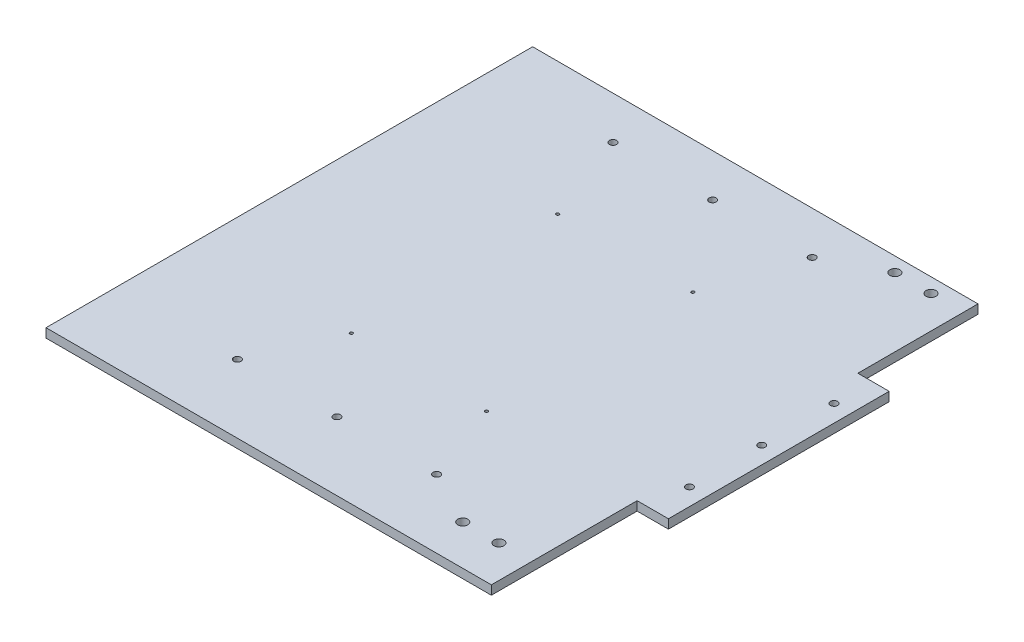
ISO-10303-21;
HEADER;
FILE_DESCRIPTION(('STEP AP214'),'2;1');
FILE_NAME('part.step','',(''),(''),'','','');
FILE_SCHEMA(('AUTOMOTIVE_DESIGN { 1 0 10303 214 1 1 1 1 }'));
ENDSEC;
DATA;
#1=APPLICATION_CONTEXT('core data for automotive mechanical design processes');
#2=APPLICATION_PROTOCOL_DEFINITION('international standard','automotive_design',2000,#1);
#3=PRODUCT_CONTEXT('',#1,'mechanical');
#4=PRODUCT('Part','Part','',(#3));
#5=PRODUCT_RELATED_PRODUCT_CATEGORY('part','',(#4));
#6=PRODUCT_DEFINITION_FORMATION('','',#4);
#7=PRODUCT_DEFINITION_CONTEXT('part definition',#1,'design');
#8=PRODUCT_DEFINITION('design','',#6,#7);
#9=PRODUCT_DEFINITION_SHAPE('','',#8);
#10=(LENGTH_UNIT() NAMED_UNIT(*) SI_UNIT(.MILLI.,.METRE.));
#11=(NAMED_UNIT(*) PLANE_ANGLE_UNIT() SI_UNIT($,.RADIAN.));
#12=(NAMED_UNIT(*) SI_UNIT($,.STERADIAN.) SOLID_ANGLE_UNIT());
#13=UNCERTAINTY_MEASURE_WITH_UNIT(LENGTH_MEASURE(1.E-05),#10,'distance_accuracy_value','');
#14=(GEOMETRIC_REPRESENTATION_CONTEXT(3) GLOBAL_UNCERTAINTY_ASSIGNED_CONTEXT((#13)) GLOBAL_UNIT_ASSIGNED_CONTEXT((#10,
#11,#12)) REPRESENTATION_CONTEXT('',''));
#15=CARTESIAN_POINT('',(0.,0.,0.));
#16=DIRECTION('',(0.,0.,1.));
#17=DIRECTION('',(1.,0.,0.));
#18=AXIS2_PLACEMENT_3D('',#15,#16,#17);
#19=CARTESIAN_POINT('',(156.499999999998,-6.35,171.));
#20=DIRECTION('',(1.,0.,0.));
#21=DIRECTION('',(0.,0.,-1.));
#22=AXIS2_PLACEMENT_3D('',#19,#20,#21);
#23=PLANE('',#22);
#24=DIRECTION('',(0.,0.,-1.));
#25=VECTOR('',#24,1.);
#26=CARTESIAN_POINT('',(156.499999999998,-6.35,171.));
#27=LINE('',#26,#25);
#28=CARTESIAN_POINT('',(156.499999999998,-6.35,171.));
#29=VERTEX_POINT('',#28);
#30=CARTESIAN_POINT('',(156.499999999998,-6.35,68.570201764885));
#31=VERTEX_POINT('',#30);
#32=EDGE_CURVE('E148',#29,#31,#27,.T.);
#33=ORIENTED_EDGE('',*,*,#32,.T.);
#34=DIRECTION('',(0.,1.,0.));
#35=VECTOR('',#34,1.);
#36=CARTESIAN_POINT('',(156.499999999998,-6.35,68.570201764885));
#37=LINE('',#36,#35);
#38=CARTESIAN_POINT('',(156.499999999998,0.,68.570201764885));
#39=VERTEX_POINT('',#38);
#40=EDGE_CURVE('E130',#31,#39,#37,.T.);
#41=ORIENTED_EDGE('',*,*,#40,.T.);
#42=DIRECTION('',(0.,0.,-1.));
#43=VECTOR('',#42,1.);
#44=CARTESIAN_POINT('',(156.499999999998,0.,171.));
#45=LINE('',#44,#43);
#46=CARTESIAN_POINT('',(156.499999999998,0.,171.));
#47=VERTEX_POINT('',#46);
#48=EDGE_CURVE('E158',#47,#39,#45,.T.);
#49=ORIENTED_EDGE('',*,*,#48,.F.);
#50=DIRECTION('',(0.,1.,0.));
#51=VECTOR('',#50,1.);
#52=CARTESIAN_POINT('',(156.499999999998,-6.35,171.));
#53=LINE('',#52,#51);
#54=EDGE_CURVE('E11',#29,#47,#53,.T.);
#55=ORIENTED_EDGE('',*,*,#54,.F.);
#56=EDGE_LOOP('',(#33,#41,#49,#55));
#57=FACE_BOUND('',#56,.T.);
#58=ADVANCED_FACE('F37',(#57),#23,.T.);
#59=DIRECTION('',(0.,1.,0.));
#60=VECTOR('',#59,1.);
#61=CARTESIAN_POINT('',(156.499999999998,-6.35,-86.570201764878));
#62=LINE('',#61,#60);
#63=CARTESIAN_POINT('',(156.499999999998,-6.35,-86.570201764878));
#64=VERTEX_POINT('',#63);
#65=CARTESIAN_POINT('',(156.499999999998,0.,-86.570201764878));
#66=VERTEX_POINT('',#65);
#67=EDGE_CURVE('E145',#64,#66,#62,.T.);
#68=ORIENTED_EDGE('',*,*,#67,.F.);
#69=CARTESIAN_POINT('',(156.499999999998,-6.35,-171.));
#70=VERTEX_POINT('',#69);
#71=EDGE_CURVE('E88',#64,#70,#27,.T.);
#72=ORIENTED_EDGE('',*,*,#71,.T.);
#73=DIRECTION('',(0.,1.,0.));
#74=VECTOR('',#73,1.);
#75=CARTESIAN_POINT('',(156.499999999998,-6.35,-171.));
#76=LINE('',#75,#74);
#77=CARTESIAN_POINT('',(156.499999999998,0.,-171.));
#78=VERTEX_POINT('',#77);
#79=EDGE_CURVE('E41',#70,#78,#76,.T.);
#80=ORIENTED_EDGE('',*,*,#79,.T.);
#81=EDGE_CURVE('E144',#66,#78,#45,.T.);
#82=ORIENTED_EDGE('',*,*,#81,.F.);
#83=EDGE_LOOP('',(#68,#72,#80,#82));
#84=FACE_BOUND('',#83,.T.);
#85=ADVANCED_FACE('F39',(#84),#23,.T.);
#86=CARTESIAN_POINT('',(-156.500000000002,-6.35,171.));
#87=DIRECTION('',(0.,0.,1.));
#88=DIRECTION('',(1.,0.,0.));
#89=AXIS2_PLACEMENT_3D('',#86,#87,#88);
#90=PLANE('',#89);
#91=DIRECTION('',(1.,0.,0.));
#92=VECTOR('',#91,1.);
#93=CARTESIAN_POINT('',(-156.500000000002,0.,171.));
#94=LINE('',#93,#92);
#95=CARTESIAN_POINT('',(-156.500000000002,0.,171.));
#96=VERTEX_POINT('',#95);
#97=EDGE_CURVE('E167',#96,#47,#94,.T.);
#98=ORIENTED_EDGE('',*,*,#97,.F.);
#99=DIRECTION('',(0.,1.,0.));
#100=VECTOR('',#99,1.);
#101=CARTESIAN_POINT('',(-156.500000000002,-6.35,171.));
#102=LINE('',#101,#100);
#103=CARTESIAN_POINT('',(-156.500000000002,-6.35,171.));
#104=VERTEX_POINT('',#103);
#105=EDGE_CURVE('E46',#104,#96,#102,.T.);
#106=ORIENTED_EDGE('',*,*,#105,.F.);
#107=DIRECTION('',(1.,0.,0.));
#108=VECTOR('',#107,1.);
#109=CARTESIAN_POINT('',(-156.500000000002,-6.35,171.));
#110=LINE('',#109,#108);
#111=EDGE_CURVE('E156',#104,#29,#110,.T.);
#112=ORIENTED_EDGE('',*,*,#111,.T.);
#113=ORIENTED_EDGE('',*,*,#54,.T.);
#114=EDGE_LOOP('',(#98,#106,#112,#113));
#115=FACE_BOUND('',#114,.T.);
#116=ADVANCED_FACE('F187',(#115),#90,.T.);
#117=CARTESIAN_POINT('',(-156.500000000002,-6.35,171.));
#118=DIRECTION('',(-1.,0.,0.));
#119=DIRECTION('',(0.,0.,1.));
#120=AXIS2_PLACEMENT_3D('',#117,#118,#119);
#121=PLANE('',#120);
#122=DIRECTION('',(0.,0.,1.));
#123=VECTOR('',#122,1.);
#124=CARTESIAN_POINT('',(-156.500000000002,0.,171.));
#125=LINE('',#124,#123);
#126=CARTESIAN_POINT('',(-156.500000000002,0.,-171.));
#127=VERTEX_POINT('',#126);
#128=EDGE_CURVE('E164',#127,#96,#125,.T.);
#129=ORIENTED_EDGE('',*,*,#128,.F.);
#130=DIRECTION('',(0.,1.,0.));
#131=VECTOR('',#130,1.);
#132=CARTESIAN_POINT('',(-156.500000000002,-6.35,-171.));
#133=LINE('',#132,#131);
#134=CARTESIAN_POINT('',(-156.500000000002,-6.35,-171.));
#135=VERTEX_POINT('',#134);
#136=EDGE_CURVE('E170',#135,#127,#133,.T.);
#137=ORIENTED_EDGE('',*,*,#136,.F.);
#138=DIRECTION('',(0.,0.,1.));
#139=VECTOR('',#138,1.);
#140=CARTESIAN_POINT('',(-156.500000000002,-6.35,171.));
#141=LINE('',#140,#139);
#142=EDGE_CURVE('E153',#135,#104,#141,.T.);
#143=ORIENTED_EDGE('',*,*,#142,.T.);
#144=ORIENTED_EDGE('',*,*,#105,.T.);
#145=EDGE_LOOP('',(#129,#137,#143,#144));
#146=FACE_BOUND('',#145,.T.);
#147=ADVANCED_FACE('F186',(#146),#121,.T.);
#148=CARTESIAN_POINT('',(-156.500000000002,-6.35,-171.));
#149=DIRECTION('',(0.,0.,-1.));
#150=DIRECTION('',(-1.,0.,0.));
#151=AXIS2_PLACEMENT_3D('',#148,#149,#150);
#152=PLANE('',#151);
#153=DIRECTION('',(-1.,0.,0.));
#154=VECTOR('',#153,1.);
#155=CARTESIAN_POINT('',(-156.500000000002,0.,-171.));
#156=LINE('',#155,#154);
#157=EDGE_CURVE('E161',#78,#127,#156,.T.);
#158=ORIENTED_EDGE('',*,*,#157,.F.);
#159=ORIENTED_EDGE('',*,*,#79,.F.);
#160=DIRECTION('',(-1.,0.,0.));
#161=VECTOR('',#160,1.);
#162=CARTESIAN_POINT('',(-156.500000000002,-6.35,-171.));
#163=LINE('',#162,#161);
#164=EDGE_CURVE('E150',#70,#135,#163,.T.);
#165=ORIENTED_EDGE('',*,*,#164,.T.);
#166=ORIENTED_EDGE('',*,*,#136,.T.);
#167=EDGE_LOOP('',(#158,#159,#165,#166));
#168=FACE_BOUND('',#167,.T.);
#169=ADVANCED_FACE('F176',(#168),#152,.T.);
#170=CARTESIAN_POINT('',(0.,-6.35,0.));
#171=DIRECTION('',(0.,-1.,0.));
#172=DIRECTION('',(0.,0.,-1.));
#173=AXIS2_PLACEMENT_3D('',#170,#171,#172);
#174=PLANE('',#173);
#175=CARTESIAN_POINT('',(49.1491727588662,-6.35000000000026,67.0560232443889));
#176=DIRECTION('',(0.,1.,0.));
#177=DIRECTION('',(0.,0.,1.));
#178=AXIS2_PLACEMENT_3D('',#175,#176,#177);
#179=CIRCLE('',#178,1.04999999999979);
#180=CARTESIAN_POINT('',(49.1491727588662,-6.35000000000026,68.1060232443887));
#181=VERTEX_POINT('',#180);
#182=EDGE_CURVE('E308',#181,#181,#179,.T.);
#183=ORIENTED_EDGE('',*,*,#182,.T.);
#184=EDGE_LOOP('',(#183));
#185=FACE_BOUND('',#184,.T.);
#186=CARTESIAN_POINT('',(-45.8508272411334,-6.35000000000026,-77.9439767556114));
#187=DIRECTION('',(0.,1.,0.));
#188=DIRECTION('',(0.,0.,1.));
#189=AXIS2_PLACEMENT_3D('',#186,#187,#188);
#190=CIRCLE('',#189,1.05000000000019);
#191=CARTESIAN_POINT('',(-45.8508272411334,-6.35000000000026,-76.8939767556112));
#192=VERTEX_POINT('',#191);
#193=EDGE_CURVE('E297',#192,#192,#190,.T.);
#194=ORIENTED_EDGE('',*,*,#193,.T.);
#195=EDGE_LOOP('',(#194));
#196=FACE_BOUND('',#195,.T.);
#197=CARTESIAN_POINT('',(-45.8508272411338,-6.35000000000026,67.0560232443886));
#198=DIRECTION('',(0.,1.,0.));
#199=DIRECTION('',(0.,0.,1.));
#200=AXIS2_PLACEMENT_3D('',#197,#198,#199);
#201=CIRCLE('',#200,1.05000000000003);
#202=CARTESIAN_POINT('',(-45.8508272411338,-6.35000000000026,68.1060232443886));
#203=VERTEX_POINT('',#202);
#204=EDGE_CURVE('E292',#203,#203,#201,.T.);
#205=ORIENTED_EDGE('',*,*,#204,.T.);
#206=EDGE_LOOP('',(#205));
#207=FACE_BOUND('',#206,.T.);
#208=CARTESIAN_POINT('',(49.1491727588667,-6.35000000000026,-77.9439767556111));
#209=DIRECTION('',(0.,1.,0.));
#210=DIRECTION('',(0.,0.,1.));
#211=AXIS2_PLACEMENT_3D('',#208,#209,#210);
#212=CIRCLE('',#211,1.05000000000002);
#213=CARTESIAN_POINT('',(49.1491727588667,-6.35000000000026,-76.893976755611));
#214=VERTEX_POINT('',#213);
#215=EDGE_CURVE('E312',#214,#214,#212,.T.);
#216=ORIENTED_EDGE('',*,*,#215,.T.);
#217=EDGE_LOOP('',(#216));
#218=FACE_BOUND('',#217,.T.);
#219=CARTESIAN_POINT('',(133.639999999999,-6.35000000000039,-160.839999999994));
#220=DIRECTION('',(0.,-1.,0.));
#221=DIRECTION('',(0.,0.,-1.));
#222=AXIS2_PLACEMENT_3D('',#219,#220,#221);
#223=CIRCLE('',#222,3.49999999999999);
#224=CARTESIAN_POINT('',(133.639999999999,-6.35000000000026,-164.339999999994));
#225=VERTEX_POINT('',#224);
#226=EDGE_CURVE('E318',#225,#225,#223,.T.);
#227=ORIENTED_EDGE('',*,*,#226,.F.);
#228=EDGE_LOOP('',(#227));
#229=FACE_BOUND('',#228,.T.);
#230=CARTESIAN_POINT('',(108.239999999999,-6.35000000000039,-160.839999999994));
#231=DIRECTION('',(0.,-1.,0.));
#232=DIRECTION('',(0.,0.,-1.));
#233=AXIS2_PLACEMENT_3D('',#230,#231,#232);
#234=CIRCLE('',#233,3.50000000000001);
#235=CARTESIAN_POINT('',(108.239999999999,-6.35000000000026,-164.339999999994));
#236=VERTEX_POINT('',#235);
#237=EDGE_CURVE('E325',#236,#236,#234,.T.);
#238=ORIENTED_EDGE('',*,*,#237,.F.);
#239=EDGE_LOOP('',(#238));
#240=FACE_BOUND('',#239,.T.);
#241=CARTESIAN_POINT('',(133.639999999998,-6.35,142.84));
#242=DIRECTION('',(0.,1.,0.));
#243=DIRECTION('',(0.,0.,1.));
#244=AXIS2_PLACEMENT_3D('',#241,#242,#243);
#245=CIRCLE('',#244,3.49999999999999);
#246=CARTESIAN_POINT('',(133.639999999998,-6.35,146.34));
#247=VERTEX_POINT('',#246);
#248=EDGE_CURVE('E330',#247,#247,#245,.T.);
#249=ORIENTED_EDGE('',*,*,#248,.T.);
#250=EDGE_LOOP('',(#249));
#251=FACE_BOUND('',#250,.T.);
#252=CARTESIAN_POINT('',(108.239999999998,-6.35,142.84));
#253=DIRECTION('',(0.,1.,0.));
#254=DIRECTION('',(0.,0.,1.));
#255=AXIS2_PLACEMENT_3D('',#252,#253,#254);
#256=CIRCLE('',#255,3.50000000000001);
#257=CARTESIAN_POINT('',(108.239999999998,-6.35,146.34));
#258=VERTEX_POINT('',#257);
#259=EDGE_CURVE('E321',#258,#258,#256,.T.);
#260=ORIENTED_EDGE('',*,*,#259,.T.);
#261=EDGE_LOOP('',(#260));
#262=FACE_BOUND('',#261,.T.);
#263=CARTESIAN_POINT('',(-70.,-6.35,123.000000000004));
#264=DIRECTION('',(0.,1.,0.));
#265=DIRECTION('',(0.,0.,1.));
#266=AXIS2_PLACEMENT_3D('',#263,#264,#265);
#267=CIRCLE('',#266,2.5);
#268=CARTESIAN_POINT('',(-70.,-6.35,125.500000000004));
#269=VERTEX_POINT('',#268);
#270=EDGE_CURVE('E352',#269,#269,#267,.T.);
#271=ORIENTED_EDGE('',*,*,#270,.T.);
#272=EDGE_LOOP('',(#271));
#273=FACE_BOUND('',#272,.T.);
#274=CARTESIAN_POINT('',(70.,-6.35,123.000000000004));
#275=DIRECTION('',(0.,1.,0.));
#276=DIRECTION('',(0.,0.,-1.));
#277=AXIS2_PLACEMENT_3D('',#274,#275,#276);
#278=CIRCLE('',#277,2.5);
#279=CARTESIAN_POINT('',(70.,-6.35,120.500000000004));
#280=VERTEX_POINT('',#279);
#281=EDGE_CURVE('E358',#280,#280,#278,.T.);
#282=ORIENTED_EDGE('',*,*,#281,.T.);
#283=EDGE_LOOP('',(#282));
#284=FACE_BOUND('',#283,.T.);
#285=CARTESIAN_POINT('',(-70.,-6.35,-140.999999999996));
#286=DIRECTION('',(0.,1.,0.));
#287=DIRECTION('',(0.,0.,-1.));
#288=AXIS2_PLACEMENT_3D('',#285,#286,#287);
#289=CIRCLE('',#288,2.5);
#290=CARTESIAN_POINT('',(-70.,-6.35,-143.499999999996));
#291=VERTEX_POINT('',#290);
#292=EDGE_CURVE('E364',#291,#291,#289,.T.);
#293=ORIENTED_EDGE('',*,*,#292,.T.);
#294=EDGE_LOOP('',(#293));
#295=FACE_BOUND('',#294,.T.);
#296=CARTESIAN_POINT('',(0.,-6.35,-140.999999999996));
#297=DIRECTION('',(0.,1.,0.));
#298=DIRECTION('',(0.,0.,-1.));
#299=AXIS2_PLACEMENT_3D('',#296,#297,#298);
#300=CIRCLE('',#299,2.49999999999999);
#301=CARTESIAN_POINT('',(0.,-6.35,-143.499999999996));
#302=VERTEX_POINT('',#301);
#303=EDGE_CURVE('E345',#302,#302,#300,.T.);
#304=ORIENTED_EDGE('',*,*,#303,.T.);
#305=EDGE_LOOP('',(#304));
#306=FACE_BOUND('',#305,.T.);
#307=CARTESIAN_POINT('',(70.,-6.35,-140.999999999996));
#308=DIRECTION('',(0.,1.,0.));
#309=DIRECTION('',(0.,0.,1.));
#310=AXIS2_PLACEMENT_3D('',#307,#308,#309);
#311=CIRCLE('',#310,2.5);
#312=CARTESIAN_POINT('',(70.,-6.35,-138.499999999996));
#313=VERTEX_POINT('',#312);
#314=EDGE_CURVE('E333',#313,#313,#311,.T.);
#315=ORIENTED_EDGE('',*,*,#314,.T.);
#316=EDGE_LOOP('',(#315));
#317=FACE_BOUND('',#316,.T.);
#318=CARTESIAN_POINT('',(0.,-6.35,123.000000000004));
#319=DIRECTION('',(0.,1.,0.));
#320=DIRECTION('',(0.,0.,1.));
#321=AXIS2_PLACEMENT_3D('',#318,#319,#320);
#322=CIRCLE('',#321,2.5);
#323=CARTESIAN_POINT('',(0.,-6.35,125.500000000004));
#324=VERTEX_POINT('',#323);
#325=EDGE_CURVE('E372',#324,#324,#322,.T.);
#326=ORIENTED_EDGE('',*,*,#325,.T.);
#327=EDGE_LOOP('',(#326));
#328=FACE_BOUND('',#327,.T.);
#329=ORIENTED_EDGE('',*,*,#32,.F.);
#330=ORIENTED_EDGE('',*,*,#111,.F.);
#331=ORIENTED_EDGE('',*,*,#142,.F.);
#332=ORIENTED_EDGE('',*,*,#164,.F.);
#333=ORIENTED_EDGE('',*,*,#71,.F.);
#334=DIRECTION('',(-1.,0.,0.));
#335=VECTOR('',#334,1.);
#336=CARTESIAN_POINT('',(178.499999999998,-6.35,-86.570201764878));
#337=LINE('',#336,#335);
#338=CARTESIAN_POINT('',(178.499999999998,-6.35,-86.570201764878));
#339=VERTEX_POINT('',#338);
#340=EDGE_CURVE('E120',#339,#64,#337,.T.);
#341=ORIENTED_EDGE('',*,*,#340,.F.);
#342=DIRECTION('',(0.,0.,-1.));
#343=VECTOR('',#342,1.);
#344=CARTESIAN_POINT('',(178.499999999998,-6.35,68.570201764885));
#345=LINE('',#344,#343);
#346=CARTESIAN_POINT('',(178.499999999998,-6.35,68.570201764885));
#347=VERTEX_POINT('',#346);
#348=EDGE_CURVE('E115',#347,#339,#345,.T.);
#349=ORIENTED_EDGE('',*,*,#348,.F.);
#350=DIRECTION('',(1.,0.,0.));
#351=VECTOR('',#350,1.);
#352=CARTESIAN_POINT('',(156.499999999998,-6.35,68.570201764885));
#353=LINE('',#352,#351);
#354=EDGE_CURVE('E127',#31,#347,#353,.T.);
#355=ORIENTED_EDGE('',*,*,#354,.F.);
#356=EDGE_LOOP('',(#329,#330,#331,#332,#333,#341,#349,#355));
#357=FACE_BOUND('',#356,.T.);
#358=CARTESIAN_POINT('',(166.499999999998,-6.35,-59.7999999999965));
#359=DIRECTION('',(0.,1.,0.));
#360=DIRECTION('',(0.,0.,-1.));
#361=AXIS2_PLACEMENT_3D('',#358,#359,#360);
#362=CIRCLE('',#361,2.5);
#363=CARTESIAN_POINT('',(166.499999999998,-6.35,-62.2999999999965));
#364=VERTEX_POINT('',#363);
#365=EDGE_CURVE('E378',#364,#364,#362,.T.);
#366=ORIENTED_EDGE('',*,*,#365,.T.);
#367=EDGE_LOOP('',(#366));
#368=FACE_BOUND('',#367,.T.);
#369=CARTESIAN_POINT('',(166.499999999998,-6.35,41.8000000000035));
#370=DIRECTION('',(0.,1.,0.));
#371=DIRECTION('',(0.,0.,1.));
#372=AXIS2_PLACEMENT_3D('',#369,#370,#371);
#373=CIRCLE('',#372,2.5);
#374=CARTESIAN_POINT('',(166.499999999998,-6.35,44.3000000000035));
#375=VERTEX_POINT('',#374);
#376=EDGE_CURVE('E384',#375,#375,#373,.T.);
#377=ORIENTED_EDGE('',*,*,#376,.T.);
#378=EDGE_LOOP('',(#377));
#379=FACE_BOUND('',#378,.T.);
#380=CARTESIAN_POINT('',(166.499999999998,-6.35,-8.99999999999648));
#381=DIRECTION('',(0.,1.,0.));
#382=DIRECTION('',(0.,0.,1.));
#383=AXIS2_PLACEMENT_3D('',#380,#381,#382);
#384=CIRCLE('',#383,2.5);
#385=CARTESIAN_POINT('',(166.499999999998,-6.35,-6.49999999999649));
#386=VERTEX_POINT('',#385);
#387=EDGE_CURVE('E141',#386,#386,#384,.T.);
#388=ORIENTED_EDGE('',*,*,#387,.T.);
#389=EDGE_LOOP('',(#388));
#390=FACE_BOUND('',#389,.T.);
#391=ADVANCED_FACE('F125',(#185,#196,#207,#218,#229,#240,#251,#262,#273,#284,#295,#306,#317,
#328,#357,#368,#379,#390),#174,.T.);
#392=CARTESIAN_POINT('',(0.,0.,0.));
#393=DIRECTION('',(0.,-1.,0.));
#394=DIRECTION('',(0.,0.,-1.));
#395=AXIS2_PLACEMENT_3D('',#392,#393,#394);
#396=PLANE('',#395);
#397=CARTESIAN_POINT('',(49.1491727588662,0.,67.0560232443889));
#398=DIRECTION('',(0.,1.,0.));
#399=DIRECTION('',(0.,0.,1.));
#400=AXIS2_PLACEMENT_3D('',#397,#398,#399);
#401=CIRCLE('',#400,1.04999999999979);
#402=CARTESIAN_POINT('',(49.1491727588662,0.,68.1060232443887));
#403=VERTEX_POINT('',#402);
#404=EDGE_CURVE('E304',#403,#403,#401,.T.);
#405=ORIENTED_EDGE('',*,*,#404,.F.);
#406=EDGE_LOOP('',(#405));
#407=FACE_BOUND('',#406,.T.);
#408=CARTESIAN_POINT('',(-45.8508272411334,0.,-77.9439767556114));
#409=DIRECTION('',(0.,1.,0.));
#410=DIRECTION('',(0.,0.,1.));
#411=AXIS2_PLACEMENT_3D('',#408,#409,#410);
#412=CIRCLE('',#411,1.05000000000019);
#413=CARTESIAN_POINT('',(-45.8508272411334,0.,-76.8939767556112));
#414=VERTEX_POINT('',#413);
#415=EDGE_CURVE('E300',#414,#414,#412,.T.);
#416=ORIENTED_EDGE('',*,*,#415,.F.);
#417=EDGE_LOOP('',(#416));
#418=FACE_BOUND('',#417,.T.);
#419=CARTESIAN_POINT('',(-45.8508272411338,0.,67.0560232443886));
#420=DIRECTION('',(0.,1.,0.));
#421=DIRECTION('',(0.,0.,1.));
#422=AXIS2_PLACEMENT_3D('',#419,#420,#421);
#423=CIRCLE('',#422,1.05000000000003);
#424=CARTESIAN_POINT('',(-45.8508272411338,0.,68.1060232443886));
#425=VERTEX_POINT('',#424);
#426=EDGE_CURVE('E295',#425,#425,#423,.T.);
#427=ORIENTED_EDGE('',*,*,#426,.F.);
#428=EDGE_LOOP('',(#427));
#429=FACE_BOUND('',#428,.T.);
#430=CARTESIAN_POINT('',(49.1491727588667,0.,-77.9439767556111));
#431=DIRECTION('',(0.,1.,0.));
#432=DIRECTION('',(0.,0.,1.));
#433=AXIS2_PLACEMENT_3D('',#430,#431,#432);
#434=CIRCLE('',#433,1.05000000000002);
#435=CARTESIAN_POINT('',(49.1491727588667,0.,-76.893976755611));
#436=VERTEX_POINT('',#435);
#437=EDGE_CURVE('E307',#436,#436,#434,.T.);
#438=ORIENTED_EDGE('',*,*,#437,.F.);
#439=EDGE_LOOP('',(#438));
#440=FACE_BOUND('',#439,.T.);
#441=CARTESIAN_POINT('',(133.639999999999,5.83162409271444E-12,-160.839999999993));
#442=DIRECTION('',(0.,-1.,0.));
#443=DIRECTION('',(0.,0.,-1.));
#444=AXIS2_PLACEMENT_3D('',#441,#442,#443);
#445=CIRCLE('',#444,3.49999999999999);
#446=CARTESIAN_POINT('',(133.639999999999,5.96604640781258E-12,-164.339999999993));
#447=VERTEX_POINT('',#446);
#448=EDGE_CURVE('E322',#447,#447,#445,.T.);
#449=ORIENTED_EDGE('',*,*,#448,.T.);
#450=EDGE_LOOP('',(#449));
#451=FACE_BOUND('',#450,.T.);
#452=CARTESIAN_POINT('',(108.239999999999,5.83162409271444E-12,-160.839999999994));
#453=DIRECTION('',(0.,-1.,0.));
#454=DIRECTION('',(0.,0.,-1.));
#455=AXIS2_PLACEMENT_3D('',#452,#453,#454);
#456=CIRCLE('',#455,3.50000000000001);
#457=CARTESIAN_POINT('',(108.239999999999,5.96604640781258E-12,-164.339999999994));
#458=VERTEX_POINT('',#457);
#459=EDGE_CURVE('E315',#458,#458,#456,.T.);
#460=ORIENTED_EDGE('',*,*,#459,.T.);
#461=EDGE_LOOP('',(#460));
#462=FACE_BOUND('',#461,.T.);
#463=CARTESIAN_POINT('',(133.639999999998,0.,142.84));
#464=DIRECTION('',(0.,1.,0.));
#465=DIRECTION('',(0.,0.,1.));
#466=AXIS2_PLACEMENT_3D('',#463,#464,#465);
#467=CIRCLE('',#466,3.49999999999999);
#468=CARTESIAN_POINT('',(133.639999999998,0.,146.34));
#469=VERTEX_POINT('',#468);
#470=EDGE_CURVE('E334',#469,#469,#467,.T.);
#471=ORIENTED_EDGE('',*,*,#470,.F.);
#472=EDGE_LOOP('',(#471));
#473=FACE_BOUND('',#472,.T.);
#474=CARTESIAN_POINT('',(108.239999999998,0.,142.84));
#475=DIRECTION('',(0.,1.,0.));
#476=DIRECTION('',(0.,0.,1.));
#477=AXIS2_PLACEMENT_3D('',#474,#475,#476);
#478=CIRCLE('',#477,3.50000000000001);
#479=CARTESIAN_POINT('',(108.239999999998,0.,146.34));
#480=VERTEX_POINT('',#479);
#481=EDGE_CURVE('E337',#480,#480,#478,.T.);
#482=ORIENTED_EDGE('',*,*,#481,.F.);
#483=EDGE_LOOP('',(#482));
#484=FACE_BOUND('',#483,.T.);
#485=CARTESIAN_POINT('',(-70.,0.,123.000000000004));
#486=DIRECTION('',(0.,1.,0.));
#487=DIRECTION('',(0.,0.,1.));
#488=AXIS2_PLACEMENT_3D('',#485,#486,#487);
#489=CIRCLE('',#488,2.5);
#490=CARTESIAN_POINT('',(-70.,0.,125.500000000004));
#491=VERTEX_POINT('',#490);
#492=EDGE_CURVE('E348',#491,#491,#489,.T.);
#493=ORIENTED_EDGE('',*,*,#492,.F.);
#494=EDGE_LOOP('',(#493));
#495=FACE_BOUND('',#494,.T.);
#496=CARTESIAN_POINT('',(70.,0.,123.000000000004));
#497=DIRECTION('',(0.,1.,0.));
#498=DIRECTION('',(0.,0.,-1.));
#499=AXIS2_PLACEMENT_3D('',#496,#497,#498);
#500=CIRCLE('',#499,2.5);
#501=CARTESIAN_POINT('',(70.,0.,120.500000000004));
#502=VERTEX_POINT('',#501);
#503=EDGE_CURVE('E355',#502,#502,#500,.T.);
#504=ORIENTED_EDGE('',*,*,#503,.F.);
#505=EDGE_LOOP('',(#504));
#506=FACE_BOUND('',#505,.T.);
#507=CARTESIAN_POINT('',(-70.,0.,-140.999999999996));
#508=DIRECTION('',(0.,1.,0.));
#509=DIRECTION('',(0.,0.,-1.));
#510=AXIS2_PLACEMENT_3D('',#507,#508,#509);
#511=CIRCLE('',#510,2.5);
#512=CARTESIAN_POINT('',(-70.,0.,-143.499999999996));
#513=VERTEX_POINT('',#512);
#514=EDGE_CURVE('E361',#513,#513,#511,.T.);
#515=ORIENTED_EDGE('',*,*,#514,.F.);
#516=EDGE_LOOP('',(#515));
#517=FACE_BOUND('',#516,.T.);
#518=CARTESIAN_POINT('',(0.,0.,-140.999999999996));
#519=DIRECTION('',(0.,1.,0.));
#520=DIRECTION('',(0.,0.,-1.));
#521=AXIS2_PLACEMENT_3D('',#518,#519,#520);
#522=CIRCLE('',#521,2.49999999999999);
#523=CARTESIAN_POINT('',(0.,0.,-143.499999999996));
#524=VERTEX_POINT('',#523);
#525=EDGE_CURVE('E367',#524,#524,#522,.T.);
#526=ORIENTED_EDGE('',*,*,#525,.F.);
#527=EDGE_LOOP('',(#526));
#528=FACE_BOUND('',#527,.T.);
#529=CARTESIAN_POINT('',(70.,0.,-140.999999999996));
#530=DIRECTION('',(0.,1.,0.));
#531=DIRECTION('',(0.,0.,1.));
#532=AXIS2_PLACEMENT_3D('',#529,#530,#531);
#533=CIRCLE('',#532,2.5);
#534=CARTESIAN_POINT('',(70.,0.,-138.499999999996));
#535=VERTEX_POINT('',#534);
#536=EDGE_CURVE('E342',#535,#535,#533,.T.);
#537=ORIENTED_EDGE('',*,*,#536,.F.);
#538=EDGE_LOOP('',(#537));
#539=FACE_BOUND('',#538,.T.);
#540=CARTESIAN_POINT('',(0.,0.,123.000000000004));
#541=DIRECTION('',(0.,1.,0.));
#542=DIRECTION('',(0.,0.,1.));
#543=AXIS2_PLACEMENT_3D('',#540,#541,#542);
#544=CIRCLE('',#543,2.5);
#545=CARTESIAN_POINT('',(0.,0.,125.500000000004));
#546=VERTEX_POINT('',#545);
#547=EDGE_CURVE('E351',#546,#546,#544,.T.);
#548=ORIENTED_EDGE('',*,*,#547,.F.);
#549=EDGE_LOOP('',(#548));
#550=FACE_BOUND('',#549,.T.);
#551=ORIENTED_EDGE('',*,*,#48,.T.);
#552=DIRECTION('',(1.,0.,0.));
#553=VECTOR('',#552,1.);
#554=CARTESIAN_POINT('',(156.499999999998,0.,68.570201764885));
#555=LINE('',#554,#553);
#556=CARTESIAN_POINT('',(178.499999999998,0.,68.570201764885));
#557=VERTEX_POINT('',#556);
#558=EDGE_CURVE('E54',#39,#557,#555,.T.);
#559=ORIENTED_EDGE('',*,*,#558,.T.);
#560=DIRECTION('',(0.,0.,-1.));
#561=VECTOR('',#560,1.);
#562=CARTESIAN_POINT('',(178.499999999998,0.,68.570201764885));
#563=LINE('',#562,#561);
#564=CARTESIAN_POINT('',(178.499999999998,0.,-86.570201764878));
#565=VERTEX_POINT('',#564);
#566=EDGE_CURVE('E117',#557,#565,#563,.T.);
#567=ORIENTED_EDGE('',*,*,#566,.T.);
#568=DIRECTION('',(-1.,0.,0.));
#569=VECTOR('',#568,1.);
#570=CARTESIAN_POINT('',(178.499999999998,0.,-86.570201764878));
#571=LINE('',#570,#569);
#572=EDGE_CURVE('E131',#565,#66,#571,.T.);
#573=ORIENTED_EDGE('',*,*,#572,.T.);
#574=ORIENTED_EDGE('',*,*,#81,.T.);
#575=ORIENTED_EDGE('',*,*,#157,.T.);
#576=ORIENTED_EDGE('',*,*,#128,.T.);
#577=ORIENTED_EDGE('',*,*,#97,.T.);
#578=EDGE_LOOP('',(#551,#559,#567,#573,#574,#575,#576,#577));
#579=FACE_BOUND('',#578,.T.);
#580=CARTESIAN_POINT('',(166.499999999998,0.,-59.7999999999965));
#581=DIRECTION('',(0.,1.,0.));
#582=DIRECTION('',(0.,0.,-1.));
#583=AXIS2_PLACEMENT_3D('',#580,#581,#582);
#584=CIRCLE('',#583,2.5);
#585=CARTESIAN_POINT('',(166.499999999998,0.,-62.2999999999965));
#586=VERTEX_POINT('',#585);
#587=EDGE_CURVE('E375',#586,#586,#584,.T.);
#588=ORIENTED_EDGE('',*,*,#587,.F.);
#589=EDGE_LOOP('',(#588));
#590=FACE_BOUND('',#589,.T.);
#591=CARTESIAN_POINT('',(166.499999999998,0.,41.8000000000035));
#592=DIRECTION('',(0.,1.,0.));
#593=DIRECTION('',(0.,0.,1.));
#594=AXIS2_PLACEMENT_3D('',#591,#592,#593);
#595=CIRCLE('',#594,2.5);
#596=CARTESIAN_POINT('',(166.499999999998,0.,44.3000000000035));
#597=VERTEX_POINT('',#596);
#598=EDGE_CURVE('E381',#597,#597,#595,.T.);
#599=ORIENTED_EDGE('',*,*,#598,.F.);
#600=EDGE_LOOP('',(#599));
#601=FACE_BOUND('',#600,.T.);
#602=CARTESIAN_POINT('',(166.499999999998,0.,-8.99999999999648));
#603=DIRECTION('',(0.,1.,0.));
#604=DIRECTION('',(0.,0.,1.));
#605=AXIS2_PLACEMENT_3D('',#602,#603,#604);
#606=CIRCLE('',#605,2.5);
#607=CARTESIAN_POINT('',(166.499999999998,0.,-6.49999999999649));
#608=VERTEX_POINT('',#607);
#609=EDGE_CURVE('E136',#608,#608,#606,.T.);
#610=ORIENTED_EDGE('',*,*,#609,.F.);
#611=EDGE_LOOP('',(#610));
#612=FACE_BOUND('',#611,.T.);
#613=ADVANCED_FACE('F178',(#407,#418,#429,#440,#451,#462,#473,#484,#495,#506,#517,#528,#539,
#550,#579,#590,#601,#612),#396,.F.);
#614=CARTESIAN_POINT('',(156.499999999998,-6.35,68.570201764885));
#615=DIRECTION('',(0.,0.,1.));
#616=DIRECTION('',(1.,0.,0.));
#617=AXIS2_PLACEMENT_3D('',#614,#615,#616);
#618=PLANE('',#617);
#619=ORIENTED_EDGE('',*,*,#558,.F.);
#620=ORIENTED_EDGE('',*,*,#40,.F.);
#621=ORIENTED_EDGE('',*,*,#354,.T.);
#622=DIRECTION('',(0.,1.,0.));
#623=VECTOR('',#622,1.);
#624=CARTESIAN_POINT('',(178.499999999998,-6.35,68.570201764885));
#625=LINE('',#624,#623);
#626=EDGE_CURVE('E112',#347,#557,#625,.T.);
#627=ORIENTED_EDGE('',*,*,#626,.T.);
#628=EDGE_LOOP('',(#619,#620,#621,#627));
#629=FACE_BOUND('',#628,.T.);
#630=ADVANCED_FACE('F129',(#629),#618,.T.);
#631=CARTESIAN_POINT('',(178.499999999998,-6.35,-86.570201764878));
#632=DIRECTION('',(0.,0.,-1.));
#633=DIRECTION('',(-1.,0.,0.));
#634=AXIS2_PLACEMENT_3D('',#631,#632,#633);
#635=PLANE('',#634);
#636=ORIENTED_EDGE('',*,*,#572,.F.);
#637=DIRECTION('',(0.,1.,0.));
#638=VECTOR('',#637,1.);
#639=CARTESIAN_POINT('',(178.499999999998,-6.35,-86.570201764878));
#640=LINE('',#639,#638);
#641=EDGE_CURVE('E119',#339,#565,#640,.T.);
#642=ORIENTED_EDGE('',*,*,#641,.F.);
#643=ORIENTED_EDGE('',*,*,#340,.T.);
#644=ORIENTED_EDGE('',*,*,#67,.T.);
#645=EDGE_LOOP('',(#636,#642,#643,#644));
#646=FACE_BOUND('',#645,.T.);
#647=ADVANCED_FACE('F182',(#646),#635,.T.);
#648=CARTESIAN_POINT('',(178.499999999998,-6.35,68.570201764885));
#649=DIRECTION('',(1.,0.,0.));
#650=DIRECTION('',(0.,0.,-1.));
#651=AXIS2_PLACEMENT_3D('',#648,#649,#650);
#652=PLANE('',#651);
#653=ORIENTED_EDGE('',*,*,#566,.F.);
#654=ORIENTED_EDGE('',*,*,#626,.F.);
#655=ORIENTED_EDGE('',*,*,#348,.T.);
#656=ORIENTED_EDGE('',*,*,#641,.T.);
#657=EDGE_LOOP('',(#653,#654,#655,#656));
#658=FACE_BOUND('',#657,.T.);
#659=ADVANCED_FACE('F114',(#658),#652,.T.);
#660=CARTESIAN_POINT('',(166.499999999998,-6.35,-8.99999999999648));
#661=DIRECTION('',(0.,1.,0.));
#662=DIRECTION('',(0.,0.,1.));
#663=AXIS2_PLACEMENT_3D('',#660,#661,#662);
#664=CYLINDRICAL_SURFACE('',#663,2.5);
#665=ORIENTED_EDGE('',*,*,#387,.F.);
#666=EDGE_LOOP('',(#665));
#667=FACE_BOUND('',#666,.T.);
#668=ORIENTED_EDGE('',*,*,#609,.T.);
#669=EDGE_LOOP('',(#668));
#670=FACE_BOUND('',#669,.T.);
#671=ADVANCED_FACE('F218',(#667,#670),#664,.F.);
#672=CARTESIAN_POINT('',(166.499999999998,-6.35,41.8000000000035));
#673=DIRECTION('',(0.,1.,0.));
#674=DIRECTION('',(0.,0.,1.));
#675=AXIS2_PLACEMENT_3D('',#672,#673,#674);
#676=CYLINDRICAL_SURFACE('',#675,2.5);
#677=ORIENTED_EDGE('',*,*,#376,.F.);
#678=EDGE_LOOP('',(#677));
#679=FACE_BOUND('',#678,.T.);
#680=ORIENTED_EDGE('',*,*,#598,.T.);
#681=EDGE_LOOP('',(#680));
#682=FACE_BOUND('',#681,.T.);
#683=ADVANCED_FACE('F223',(#679,#682),#676,.F.);
#684=CARTESIAN_POINT('',(166.499999999998,-6.35,-59.7999999999965));
#685=DIRECTION('',(0.,1.,0.));
#686=DIRECTION('',(0.,0.,1.));
#687=AXIS2_PLACEMENT_3D('',#684,#685,#686);
#688=CYLINDRICAL_SURFACE('',#687,2.5);
#689=ORIENTED_EDGE('',*,*,#365,.F.);
#690=EDGE_LOOP('',(#689));
#691=FACE_BOUND('',#690,.T.);
#692=ORIENTED_EDGE('',*,*,#587,.T.);
#693=EDGE_LOOP('',(#692));
#694=FACE_BOUND('',#693,.T.);
#695=ADVANCED_FACE('F227',(#691,#694),#688,.F.);
#696=CARTESIAN_POINT('',(0.,-6.35,123.000000000004));
#697=DIRECTION('',(0.,1.,0.));
#698=DIRECTION('',(0.,0.,1.));
#699=AXIS2_PLACEMENT_3D('',#696,#697,#698);
#700=CYLINDRICAL_SURFACE('',#699,2.5);
#701=ORIENTED_EDGE('',*,*,#325,.F.);
#702=EDGE_LOOP('',(#701));
#703=FACE_BOUND('',#702,.T.);
#704=ORIENTED_EDGE('',*,*,#547,.T.);
#705=EDGE_LOOP('',(#704));
#706=FACE_BOUND('',#705,.T.);
#707=ADVANCED_FACE('F231',(#703,#706),#700,.F.);
#708=CARTESIAN_POINT('',(70.,-6.35,-140.999999999996));
#709=DIRECTION('',(0.,1.,0.));
#710=DIRECTION('',(0.,0.,1.));
#711=AXIS2_PLACEMENT_3D('',#708,#709,#710);
#712=CYLINDRICAL_SURFACE('',#711,2.5);
#713=ORIENTED_EDGE('',*,*,#314,.F.);
#714=EDGE_LOOP('',(#713));
#715=FACE_BOUND('',#714,.T.);
#716=ORIENTED_EDGE('',*,*,#536,.T.);
#717=EDGE_LOOP('',(#716));
#718=FACE_BOUND('',#717,.T.);
#719=ADVANCED_FACE('F235',(#715,#718),#712,.F.);
#720=CARTESIAN_POINT('',(0.,-6.35,-140.999999999996));
#721=DIRECTION('',(0.,1.,0.));
#722=DIRECTION('',(0.,0.,1.));
#723=AXIS2_PLACEMENT_3D('',#720,#721,#722);
#724=CYLINDRICAL_SURFACE('',#723,2.49999999999999);
#725=ORIENTED_EDGE('',*,*,#303,.F.);
#726=EDGE_LOOP('',(#725));
#727=FACE_BOUND('',#726,.T.);
#728=ORIENTED_EDGE('',*,*,#525,.T.);
#729=EDGE_LOOP('',(#728));
#730=FACE_BOUND('',#729,.T.);
#731=ADVANCED_FACE('F237',(#727,#730),#724,.F.);
#732=CARTESIAN_POINT('',(-70.,-6.35,-140.999999999996));
#733=DIRECTION('',(0.,1.,0.));
#734=DIRECTION('',(0.,0.,1.));
#735=AXIS2_PLACEMENT_3D('',#732,#733,#734);
#736=CYLINDRICAL_SURFACE('',#735,2.5);
#737=ORIENTED_EDGE('',*,*,#292,.F.);
#738=EDGE_LOOP('',(#737));
#739=FACE_BOUND('',#738,.T.);
#740=ORIENTED_EDGE('',*,*,#514,.T.);
#741=EDGE_LOOP('',(#740));
#742=FACE_BOUND('',#741,.T.);
#743=ADVANCED_FACE('F240',(#739,#742),#736,.F.);
#744=CARTESIAN_POINT('',(70.,-6.35,123.000000000004));
#745=DIRECTION('',(0.,1.,0.));
#746=DIRECTION('',(0.,0.,1.));
#747=AXIS2_PLACEMENT_3D('',#744,#745,#746);
#748=CYLINDRICAL_SURFACE('',#747,2.5);
#749=ORIENTED_EDGE('',*,*,#281,.F.);
#750=EDGE_LOOP('',(#749));
#751=FACE_BOUND('',#750,.T.);
#752=ORIENTED_EDGE('',*,*,#503,.T.);
#753=EDGE_LOOP('',(#752));
#754=FACE_BOUND('',#753,.T.);
#755=ADVANCED_FACE('F244',(#751,#754),#748,.F.);
#756=CARTESIAN_POINT('',(-70.,-6.35,123.000000000004));
#757=DIRECTION('',(0.,1.,0.));
#758=DIRECTION('',(0.,0.,1.));
#759=AXIS2_PLACEMENT_3D('',#756,#757,#758);
#760=CYLINDRICAL_SURFACE('',#759,2.5);
#761=ORIENTED_EDGE('',*,*,#270,.F.);
#762=EDGE_LOOP('',(#761));
#763=FACE_BOUND('',#762,.T.);
#764=ORIENTED_EDGE('',*,*,#492,.T.);
#765=EDGE_LOOP('',(#764));
#766=FACE_BOUND('',#765,.T.);
#767=ADVANCED_FACE('F248',(#763,#766),#760,.F.);
#768=CARTESIAN_POINT('',(108.239999999998,-6.35,142.84));
#769=DIRECTION('',(0.,1.,0.));
#770=DIRECTION('',(0.,0.,1.));
#771=AXIS2_PLACEMENT_3D('',#768,#769,#770);
#772=CYLINDRICAL_SURFACE('',#771,3.50000000000001);
#773=ORIENTED_EDGE('',*,*,#259,.F.);
#774=EDGE_LOOP('',(#773));
#775=FACE_BOUND('',#774,.T.);
#776=ORIENTED_EDGE('',*,*,#481,.T.);
#777=EDGE_LOOP('',(#776));
#778=FACE_BOUND('',#777,.T.);
#779=ADVANCED_FACE('F252',(#775,#778),#772,.F.);
#780=CARTESIAN_POINT('',(133.639999999998,-6.35,142.84));
#781=DIRECTION('',(0.,1.,0.));
#782=DIRECTION('',(0.,0.,1.));
#783=AXIS2_PLACEMENT_3D('',#780,#781,#782);
#784=CYLINDRICAL_SURFACE('',#783,3.49999999999999);
#785=ORIENTED_EDGE('',*,*,#248,.F.);
#786=EDGE_LOOP('',(#785));
#787=FACE_BOUND('',#786,.T.);
#788=ORIENTED_EDGE('',*,*,#470,.T.);
#789=EDGE_LOOP('',(#788));
#790=FACE_BOUND('',#789,.T.);
#791=ADVANCED_FACE('F259',(#787,#790),#784,.F.);
#792=CARTESIAN_POINT('',(108.239999999999,-6.35000000000039,-160.839999999994));
#793=DIRECTION('',(0.,1.,0.));
#794=DIRECTION('',(0.,0.,1.));
#795=AXIS2_PLACEMENT_3D('',#792,#793,#794);
#796=CYLINDRICAL_SURFACE('',#795,3.50000000000001);
#797=ORIENTED_EDGE('',*,*,#237,.T.);
#798=EDGE_LOOP('',(#797));
#799=FACE_BOUND('',#798,.T.);
#800=ORIENTED_EDGE('',*,*,#459,.F.);
#801=EDGE_LOOP('',(#800));
#802=FACE_BOUND('',#801,.T.);
#803=ADVANCED_FACE('F263',(#799,#802),#796,.F.);
#804=CARTESIAN_POINT('',(133.639999999999,-6.35000000000039,-160.839999999994));
#805=DIRECTION('',(0.,1.,0.));
#806=DIRECTION('',(0.,0.,1.));
#807=AXIS2_PLACEMENT_3D('',#804,#805,#806);
#808=CYLINDRICAL_SURFACE('',#807,3.49999999999999);
#809=ORIENTED_EDGE('',*,*,#226,.T.);
#810=EDGE_LOOP('',(#809));
#811=FACE_BOUND('',#810,.T.);
#812=ORIENTED_EDGE('',*,*,#448,.F.);
#813=EDGE_LOOP('',(#812));
#814=FACE_BOUND('',#813,.T.);
#815=ADVANCED_FACE('F267',(#811,#814),#808,.F.);
#816=CARTESIAN_POINT('',(49.1491727588667,-6.35000000000026,-77.9439767556111));
#817=DIRECTION('',(0.,1.,0.));
#818=DIRECTION('',(0.,0.,1.));
#819=AXIS2_PLACEMENT_3D('',#816,#817,#818);
#820=CYLINDRICAL_SURFACE('',#819,1.05000000000002);
#821=ORIENTED_EDGE('',*,*,#215,.F.);
#822=EDGE_LOOP('',(#821));
#823=FACE_BOUND('',#822,.T.);
#824=ORIENTED_EDGE('',*,*,#437,.T.);
#825=EDGE_LOOP('',(#824));
#826=FACE_BOUND('',#825,.T.);
#827=ADVANCED_FACE('F271',(#823,#826),#820,.F.);
#828=CARTESIAN_POINT('',(-45.8508272411338,-6.35000000000026,67.0560232443886));
#829=DIRECTION('',(0.,1.,0.));
#830=DIRECTION('',(0.,0.,1.));
#831=AXIS2_PLACEMENT_3D('',#828,#829,#830);
#832=CYLINDRICAL_SURFACE('',#831,1.05000000000003);
#833=ORIENTED_EDGE('',*,*,#204,.F.);
#834=EDGE_LOOP('',(#833));
#835=FACE_BOUND('',#834,.T.);
#836=ORIENTED_EDGE('',*,*,#426,.T.);
#837=EDGE_LOOP('',(#836));
#838=FACE_BOUND('',#837,.T.);
#839=ADVANCED_FACE('F275',(#835,#838),#832,.F.);
#840=CARTESIAN_POINT('',(-45.8508272411334,-6.35000000000026,-77.9439767556114));
#841=DIRECTION('',(0.,1.,0.));
#842=DIRECTION('',(0.,0.,1.));
#843=AXIS2_PLACEMENT_3D('',#840,#841,#842);
#844=CYLINDRICAL_SURFACE('',#843,1.05000000000019);
#845=ORIENTED_EDGE('',*,*,#193,.F.);
#846=EDGE_LOOP('',(#845));
#847=FACE_BOUND('',#846,.T.);
#848=ORIENTED_EDGE('',*,*,#415,.T.);
#849=EDGE_LOOP('',(#848));
#850=FACE_BOUND('',#849,.T.);
#851=ADVANCED_FACE('F277',(#847,#850),#844,.F.);
#852=CARTESIAN_POINT('',(49.1491727588662,-6.35000000000026,67.0560232443889));
#853=DIRECTION('',(0.,1.,0.));
#854=DIRECTION('',(0.,0.,1.));
#855=AXIS2_PLACEMENT_3D('',#852,#853,#854);
#856=CYLINDRICAL_SURFACE('',#855,1.04999999999979);
#857=ORIENTED_EDGE('',*,*,#182,.F.);
#858=EDGE_LOOP('',(#857));
#859=FACE_BOUND('',#858,.T.);
#860=ORIENTED_EDGE('',*,*,#404,.T.);
#861=EDGE_LOOP('',(#860));
#862=FACE_BOUND('',#861,.T.);
#863=ADVANCED_FACE('F280',(#859,#862),#856,.F.);
#864=CLOSED_SHELL('',(#58,#85,#116,#147,#169,#391,#613,#630,#647,#659,#671,#683,#695,#707,#719,
#731,#743,#755,#767,#779,#791,#803,#815,#827,#839,#851,#863));
#865=MANIFOLD_SOLID_BREP('B2',#864);
#866=ADVANCED_BREP_SHAPE_REPRESENTATION('',(#18,#865),#14);
#867=SHAPE_DEFINITION_REPRESENTATION(#9,#866);
ENDSEC;
END-ISO-10303-21;
